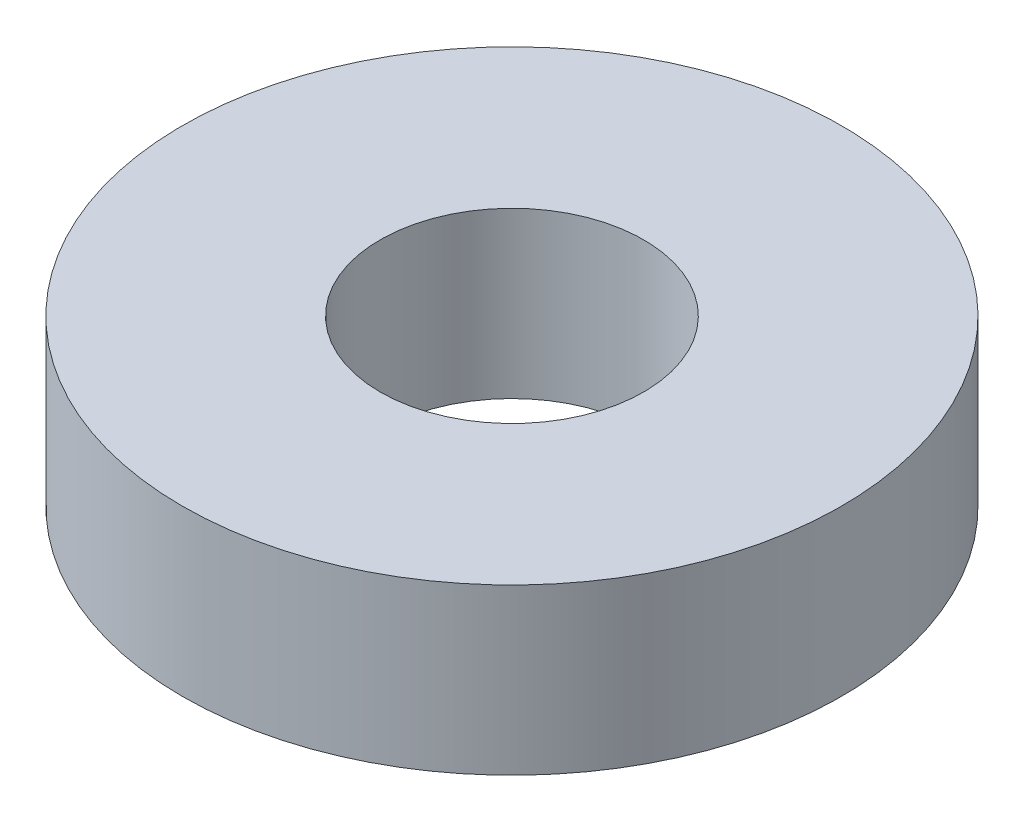
ISO-10303-21;
HEADER;
FILE_DESCRIPTION(('STEP AP214'),'2;1');
FILE_NAME('part.step','',(''),(''),'','','');
FILE_SCHEMA(('AUTOMOTIVE_DESIGN { 1 0 10303 214 1 1 1 1 }'));
ENDSEC;
DATA;
#1=APPLICATION_CONTEXT('core data for automotive mechanical design processes');
#2=APPLICATION_PROTOCOL_DEFINITION('international standard','automotive_design',2000,#1);
#3=PRODUCT_CONTEXT('',#1,'mechanical');
#4=PRODUCT('Part','Part','',(#3));
#5=PRODUCT_RELATED_PRODUCT_CATEGORY('part','',(#4));
#6=PRODUCT_DEFINITION_FORMATION('','',#4);
#7=PRODUCT_DEFINITION_CONTEXT('part definition',#1,'design');
#8=PRODUCT_DEFINITION('design','',#6,#7);
#9=PRODUCT_DEFINITION_SHAPE('','',#8);
#10=(LENGTH_UNIT() NAMED_UNIT(*) SI_UNIT(.MILLI.,.METRE.));
#11=(NAMED_UNIT(*) PLANE_ANGLE_UNIT() SI_UNIT($,.RADIAN.));
#12=(NAMED_UNIT(*) SI_UNIT($,.STERADIAN.) SOLID_ANGLE_UNIT());
#13=UNCERTAINTY_MEASURE_WITH_UNIT(LENGTH_MEASURE(1.E-05),#10,'distance_accuracy_value','');
#14=(GEOMETRIC_REPRESENTATION_CONTEXT(3) GLOBAL_UNCERTAINTY_ASSIGNED_CONTEXT((#13)) GLOBAL_UNIT_ASSIGNED_CONTEXT((#10,
#11,#12)) REPRESENTATION_CONTEXT('',''));
#15=CARTESIAN_POINT('',(0.,0.,0.));
#16=DIRECTION('',(0.,0.,1.));
#17=DIRECTION('',(1.,0.,0.));
#18=AXIS2_PLACEMENT_3D('',#15,#16,#17);
#19=CARTESIAN_POINT('',(0.,5.,0.));
#20=DIRECTION('',(0.,1.,0.));
#21=DIRECTION('',(0.,0.,1.));
#22=AXIS2_PLACEMENT_3D('',#19,#20,#21);
#23=PLANE('',#22);
#24=CARTESIAN_POINT('',(0.,5.,0.));
#25=DIRECTION('',(0.,1.,0.));
#26=DIRECTION('',(0.,0.,1.));
#27=AXIS2_PLACEMENT_3D('',#24,#25,#26);
#28=CIRCLE('',#27,10.);
#29=CARTESIAN_POINT('',(0.,5.,10.));
#30=VERTEX_POINT('',#29);
#31=EDGE_CURVE('E10',#30,#30,#28,.T.);
#32=ORIENTED_EDGE('',*,*,#31,.T.);
#33=EDGE_LOOP('',(#32));
#34=FACE_BOUND('',#33,.T.);
#35=CARTESIAN_POINT('',(0.,5.,0.));
#36=DIRECTION('',(0.,1.,0.));
#37=DIRECTION('',(0.,0.,1.));
#38=AXIS2_PLACEMENT_3D('',#35,#36,#37);
#39=CIRCLE('',#38,4.);
#40=CARTESIAN_POINT('',(0.,5.,4.));
#41=VERTEX_POINT('',#40);
#42=EDGE_CURVE('E42',#41,#41,#39,.T.);
#43=ORIENTED_EDGE('',*,*,#42,.F.);
#44=EDGE_LOOP('',(#43));
#45=FACE_BOUND('',#44,.T.);
#46=ADVANCED_FACE('F31',(#34,#45),#23,.T.);
#47=CARTESIAN_POINT('',(0.,0.,0.));
#48=DIRECTION('',(0.,1.,0.));
#49=DIRECTION('',(0.,0.,1.));
#50=AXIS2_PLACEMENT_3D('',#47,#48,#49);
#51=PLANE('',#50);
#52=CARTESIAN_POINT('',(0.,0.,0.));
#53=DIRECTION('',(0.,1.,0.));
#54=DIRECTION('',(0.,0.,1.));
#55=AXIS2_PLACEMENT_3D('',#52,#53,#54);
#56=CIRCLE('',#55,10.);
#57=CARTESIAN_POINT('',(0.,0.,10.));
#58=VERTEX_POINT('',#57);
#59=EDGE_CURVE('E35',#58,#58,#56,.T.);
#60=ORIENTED_EDGE('',*,*,#59,.F.);
#61=EDGE_LOOP('',(#60));
#62=FACE_BOUND('',#61,.T.);
#63=CARTESIAN_POINT('',(0.,0.,0.));
#64=DIRECTION('',(0.,1.,0.));
#65=DIRECTION('',(0.,0.,1.));
#66=AXIS2_PLACEMENT_3D('',#63,#64,#65);
#67=CIRCLE('',#66,4.);
#68=CARTESIAN_POINT('',(0.,0.,4.));
#69=VERTEX_POINT('',#68);
#70=EDGE_CURVE('E44',#69,#69,#67,.T.);
#71=ORIENTED_EDGE('',*,*,#70,.T.);
#72=EDGE_LOOP('',(#71));
#73=FACE_BOUND('',#72,.T.);
#74=ADVANCED_FACE('F54',(#62,#73),#51,.F.);
#75=CARTESIAN_POINT('',(0.,5.,0.));
#76=DIRECTION('',(0.,-1.,0.));
#77=DIRECTION('',(0.,0.,-1.));
#78=AXIS2_PLACEMENT_3D('',#75,#76,#77);
#79=CYLINDRICAL_SURFACE('',#78,10.);
#80=ORIENTED_EDGE('',*,*,#31,.F.);
#81=EDGE_LOOP('',(#80));
#82=FACE_BOUND('',#81,.T.);
#83=ORIENTED_EDGE('',*,*,#59,.T.);
#84=EDGE_LOOP('',(#83));
#85=FACE_BOUND('',#84,.T.);
#86=ADVANCED_FACE('F33',(#82,#85),#79,.T.);
#87=CARTESIAN_POINT('',(0.,5.,0.));
#88=DIRECTION('',(0.,-1.,0.));
#89=DIRECTION('',(0.,0.,-1.));
#90=AXIS2_PLACEMENT_3D('',#87,#88,#89);
#91=CYLINDRICAL_SURFACE('',#90,4.);
#92=ORIENTED_EDGE('',*,*,#42,.T.);
#93=EDGE_LOOP('',(#92));
#94=FACE_BOUND('',#93,.T.);
#95=ORIENTED_EDGE('',*,*,#70,.F.);
#96=EDGE_LOOP('',(#95));
#97=FACE_BOUND('',#96,.T.);
#98=ADVANCED_FACE('F50',(#94,#97),#91,.F.);
#99=CLOSED_SHELL('',(#46,#74,#86,#98));
#100=MANIFOLD_SOLID_BREP('B2',#99);
#101=ADVANCED_BREP_SHAPE_REPRESENTATION('',(#18,#100),#14);
#102=SHAPE_DEFINITION_REPRESENTATION(#9,#101);
ENDSEC;
END-ISO-10303-21;
